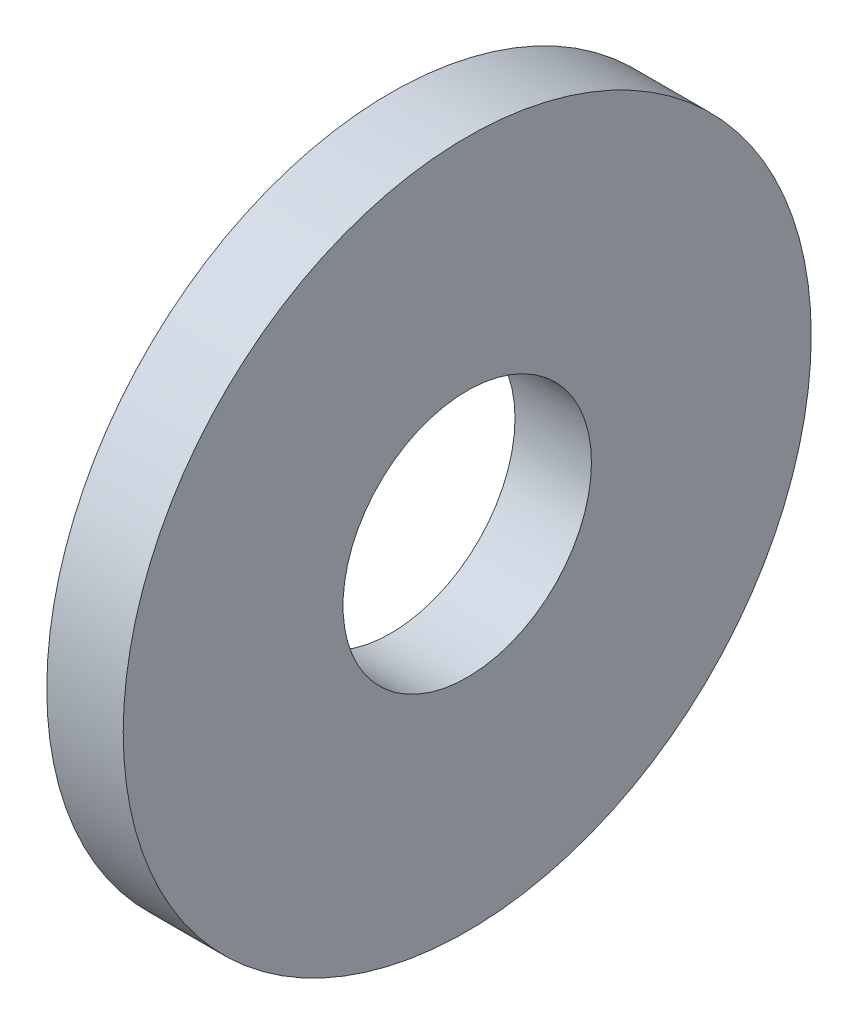
ISO-10303-21;
HEADER;
FILE_DESCRIPTION(('STEP AP214'),'2;1');
FILE_NAME('part.step','',(''),(''),'','','');
FILE_SCHEMA(('AUTOMOTIVE_DESIGN { 1 0 10303 214 1 1 1 1 }'));
ENDSEC;
DATA;
#1=APPLICATION_CONTEXT('core data for automotive mechanical design processes');
#2=APPLICATION_PROTOCOL_DEFINITION('international standard','automotive_design',2000,#1);
#3=PRODUCT_CONTEXT('',#1,'mechanical');
#4=PRODUCT('Part','Part','',(#3));
#5=PRODUCT_RELATED_PRODUCT_CATEGORY('part','',(#4));
#6=PRODUCT_DEFINITION_FORMATION('','',#4);
#7=PRODUCT_DEFINITION_CONTEXT('part definition',#1,'design');
#8=PRODUCT_DEFINITION('design','',#6,#7);
#9=PRODUCT_DEFINITION_SHAPE('','',#8);
#10=(LENGTH_UNIT() NAMED_UNIT(*) SI_UNIT(.MILLI.,.METRE.));
#11=(NAMED_UNIT(*) PLANE_ANGLE_UNIT() SI_UNIT($,.RADIAN.));
#12=(NAMED_UNIT(*) SI_UNIT($,.STERADIAN.) SOLID_ANGLE_UNIT());
#13=UNCERTAINTY_MEASURE_WITH_UNIT(LENGTH_MEASURE(1.E-05),#10,'distance_accuracy_value','');
#14=(GEOMETRIC_REPRESENTATION_CONTEXT(3) GLOBAL_UNCERTAINTY_ASSIGNED_CONTEXT((#13)) GLOBAL_UNIT_ASSIGNED_CONTEXT((#10,
#11,#12)) REPRESENTATION_CONTEXT('',''));
#15=CARTESIAN_POINT('',(0.,0.,0.));
#16=DIRECTION('',(0.,0.,1.));
#17=DIRECTION('',(1.,0.,0.));
#18=AXIS2_PLACEMENT_3D('',#15,#16,#17);
#19=CARTESIAN_POINT('',(2.,0.,0.));
#20=DIRECTION('',(-1.,0.,0.));
#21=DIRECTION('',(0.,0.,1.));
#22=AXIS2_PLACEMENT_3D('',#19,#20,#21);
#23=CYLINDRICAL_SURFACE('',#22,9.);
#24=CARTESIAN_POINT('',(2.,0.,0.));
#25=DIRECTION('',(1.,0.,0.));
#26=DIRECTION('',(0.,0.,-1.));
#27=AXIS2_PLACEMENT_3D('',#24,#25,#26);
#28=CIRCLE('',#27,9.);
#29=CARTESIAN_POINT('',(2.,0.,-9.));
#30=VERTEX_POINT('',#29);
#31=EDGE_CURVE('E10',#30,#30,#28,.T.);
#32=ORIENTED_EDGE('',*,*,#31,.F.);
#33=EDGE_LOOP('',(#32));
#34=FACE_BOUND('',#33,.T.);
#35=CARTESIAN_POINT('',(0.,0.,0.));
#36=DIRECTION('',(1.,0.,0.));
#37=DIRECTION('',(0.,0.,-1.));
#38=AXIS2_PLACEMENT_3D('',#35,#36,#37);
#39=CIRCLE('',#38,9.);
#40=CARTESIAN_POINT('',(0.,0.,-9.));
#41=VERTEX_POINT('',#40);
#42=EDGE_CURVE('E34',#41,#41,#39,.T.);
#43=ORIENTED_EDGE('',*,*,#42,.T.);
#44=EDGE_LOOP('',(#43));
#45=FACE_BOUND('',#44,.T.);
#46=ADVANCED_FACE('F31',(#34,#45),#23,.T.);
#47=CARTESIAN_POINT('',(2.,0.,0.));
#48=DIRECTION('',(1.,0.,0.));
#49=DIRECTION('',(0.,0.,-1.));
#50=AXIS2_PLACEMENT_3D('',#47,#48,#49);
#51=PLANE('',#50);
#52=CARTESIAN_POINT('',(2.,0.,0.));
#53=DIRECTION('',(1.,0.,0.));
#54=DIRECTION('',(0.,0.,-1.));
#55=AXIS2_PLACEMENT_3D('',#52,#53,#54);
#56=CIRCLE('',#55,3.25);
#57=CARTESIAN_POINT('',(2.,0.,-3.25));
#58=VERTEX_POINT('',#57);
#59=EDGE_CURVE('E43',#58,#58,#56,.T.);
#60=ORIENTED_EDGE('',*,*,#59,.F.);
#61=EDGE_LOOP('',(#60));
#62=FACE_BOUND('',#61,.T.);
#63=ORIENTED_EDGE('',*,*,#31,.T.);
#64=EDGE_LOOP('',(#63));
#65=FACE_BOUND('',#64,.T.);
#66=ADVANCED_FACE('F58',(#62,#65),#51,.T.);
#67=CARTESIAN_POINT('',(0.,0.,0.));
#68=DIRECTION('',(1.,0.,0.));
#69=DIRECTION('',(0.,0.,-1.));
#70=AXIS2_PLACEMENT_3D('',#67,#68,#69);
#71=PLANE('',#70);
#72=CARTESIAN_POINT('',(0.,0.,0.));
#73=DIRECTION('',(1.,0.,0.));
#74=DIRECTION('',(0.,0.,-1.));
#75=AXIS2_PLACEMENT_3D('',#72,#73,#74);
#76=CIRCLE('',#75,3.25);
#77=CARTESIAN_POINT('',(0.,0.,-3.25));
#78=VERTEX_POINT('',#77);
#79=EDGE_CURVE('E41',#78,#78,#76,.T.);
#80=ORIENTED_EDGE('',*,*,#79,.T.);
#81=EDGE_LOOP('',(#80));
#82=FACE_BOUND('',#81,.T.);
#83=ORIENTED_EDGE('',*,*,#42,.F.);
#84=EDGE_LOOP('',(#83));
#85=FACE_BOUND('',#84,.T.);
#86=ADVANCED_FACE('F49',(#82,#85),#71,.F.);
#87=CARTESIAN_POINT('',(0.,0.,0.));
#88=DIRECTION('',(1.,0.,0.));
#89=DIRECTION('',(0.,0.,-1.));
#90=AXIS2_PLACEMENT_3D('',#87,#88,#89);
#91=CYLINDRICAL_SURFACE('',#90,3.25);
#92=ORIENTED_EDGE('',*,*,#79,.F.);
#93=EDGE_LOOP('',(#92));
#94=FACE_BOUND('',#93,.T.);
#95=ORIENTED_EDGE('',*,*,#59,.T.);
#96=EDGE_LOOP('',(#95));
#97=FACE_BOUND('',#96,.T.);
#98=ADVANCED_FACE('F52',(#94,#97),#91,.F.);
#99=CLOSED_SHELL('',(#46,#66,#86,#98));
#100=MANIFOLD_SOLID_BREP('B2',#99);
#101=ADVANCED_BREP_SHAPE_REPRESENTATION('',(#18,#100),#14);
#102=SHAPE_DEFINITION_REPRESENTATION(#9,#101);
ENDSEC;
END-ISO-10303-21;
